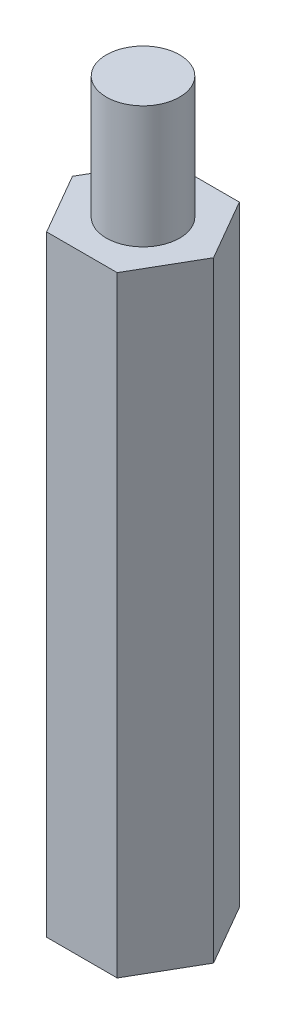
ISO-10303-21;
HEADER;
FILE_DESCRIPTION(('STEP AP214'),'2;1');
FILE_NAME('part.step','',(''),(''),'','','');
FILE_SCHEMA(('AUTOMOTIVE_DESIGN { 1 0 10303 214 1 1 1 1 }'));
ENDSEC;
DATA;
#1=APPLICATION_CONTEXT('core data for automotive mechanical design processes');
#2=APPLICATION_PROTOCOL_DEFINITION('international standard','automotive_design',2000,#1);
#3=PRODUCT_CONTEXT('',#1,'mechanical');
#4=PRODUCT('Part','Part','',(#3));
#5=PRODUCT_RELATED_PRODUCT_CATEGORY('part','',(#4));
#6=PRODUCT_DEFINITION_FORMATION('','',#4);
#7=PRODUCT_DEFINITION_CONTEXT('part definition',#1,'design');
#8=PRODUCT_DEFINITION('design','',#6,#7);
#9=PRODUCT_DEFINITION_SHAPE('','',#8);
#10=(LENGTH_UNIT() NAMED_UNIT(*) SI_UNIT(.MILLI.,.METRE.));
#11=(NAMED_UNIT(*) PLANE_ANGLE_UNIT() SI_UNIT($,.RADIAN.));
#12=(NAMED_UNIT(*) SI_UNIT($,.STERADIAN.) SOLID_ANGLE_UNIT());
#13=UNCERTAINTY_MEASURE_WITH_UNIT(LENGTH_MEASURE(1.E-05),#10,'distance_accuracy_value','');
#14=(GEOMETRIC_REPRESENTATION_CONTEXT(3) GLOBAL_UNCERTAINTY_ASSIGNED_CONTEXT((#13)) GLOBAL_UNIT_ASSIGNED_CONTEXT((#10,
#11,#12)) REPRESENTATION_CONTEXT('',''));
#15=CARTESIAN_POINT('',(0.,0.,0.));
#16=DIRECTION('',(0.,0.,1.));
#17=DIRECTION('',(1.,0.,0.));
#18=AXIS2_PLACEMENT_3D('',#15,#16,#17);
#19=CARTESIAN_POINT('',(1.44337567297409,25.,2.49999999999997));
#20=DIRECTION('',(-0.866025403784442,0.,-0.499999999999995));
#21=DIRECTION('',(-0.499999999999995,0.,0.866025403784442));
#22=AXIS2_PLACEMENT_3D('',#19,#20,#21);
#23=PLANE('',#22);
#24=DIRECTION('',(0.499999999999995,0.,-0.866025403784442));
#25=VECTOR('',#24,1.);
#26=CARTESIAN_POINT('',(1.44337567297409,0.,2.49999999999997));
#27=LINE('',#26,#25);
#28=CARTESIAN_POINT('',(1.44337567297409,0.,2.49999999999997));
#29=VERTEX_POINT('',#28);
#30=CARTESIAN_POINT('',(2.88675134594812,0.,0.));
#31=VERTEX_POINT('',#30);
#32=EDGE_CURVE('E119',#29,#31,#27,.T.);
#33=ORIENTED_EDGE('',*,*,#32,.T.);
#34=DIRECTION('',(0.,-1.,0.));
#35=VECTOR('',#34,1.);
#36=CARTESIAN_POINT('',(2.88675134594812,25.,0.));
#37=LINE('',#36,#35);
#38=CARTESIAN_POINT('',(2.88675134594812,25.,0.));
#39=VERTEX_POINT('',#38);
#40=EDGE_CURVE('E36',#39,#31,#37,.T.);
#41=ORIENTED_EDGE('',*,*,#40,.F.);
#42=DIRECTION('',(0.499999999999995,0.,-0.866025403784442));
#43=VECTOR('',#42,1.);
#44=CARTESIAN_POINT('',(1.44337567297409,25.,2.49999999999997));
#45=LINE('',#44,#43);
#46=CARTESIAN_POINT('',(1.44337567297409,25.,2.49999999999997));
#47=VERTEX_POINT('',#46);
#48=EDGE_CURVE('E130',#47,#39,#45,.T.);
#49=ORIENTED_EDGE('',*,*,#48,.F.);
#50=DIRECTION('',(0.,-1.,0.));
#51=VECTOR('',#50,1.);
#52=CARTESIAN_POINT('',(1.44337567297409,25.,2.49999999999997));
#53=LINE('',#52,#51);
#54=EDGE_CURVE('E115',#47,#29,#53,.T.);
#55=ORIENTED_EDGE('',*,*,#54,.T.);
#56=EDGE_LOOP('',(#33,#41,#49,#55));
#57=FACE_BOUND('',#56,.T.);
#58=ADVANCED_FACE('F33',(#57),#23,.F.);
#59=CARTESIAN_POINT('',(2.88675134594812,25.,0.));
#60=DIRECTION('',(-0.866025403784438,0.,0.500000000000001));
#61=DIRECTION('',(0.500000000000001,0.,0.866025403784438));
#62=AXIS2_PLACEMENT_3D('',#59,#60,#61);
#63=PLANE('',#62);
#64=DIRECTION('',(-0.500000000000001,0.,-0.866025403784438));
#65=VECTOR('',#64,1.);
#66=CARTESIAN_POINT('',(2.88675134594812,0.,0.));
#67=LINE('',#66,#65);
#68=CARTESIAN_POINT('',(1.44337567297405,0.,-2.49999999999999));
#69=VERTEX_POINT('',#68);
#70=EDGE_CURVE('E122',#31,#69,#67,.T.);
#71=ORIENTED_EDGE('',*,*,#70,.T.);
#72=DIRECTION('',(0.,-1.,0.));
#73=VECTOR('',#72,1.);
#74=CARTESIAN_POINT('',(1.44337567297405,25.,-2.49999999999999));
#75=LINE('',#74,#73);
#76=CARTESIAN_POINT('',(1.44337567297405,25.,-2.49999999999999));
#77=VERTEX_POINT('',#76);
#78=EDGE_CURVE('E133',#77,#69,#75,.T.);
#79=ORIENTED_EDGE('',*,*,#78,.F.);
#80=DIRECTION('',(-0.500000000000001,0.,-0.866025403784438));
#81=VECTOR('',#80,1.);
#82=CARTESIAN_POINT('',(2.88675134594812,25.,0.));
#83=LINE('',#82,#81);
#84=EDGE_CURVE('E88',#39,#77,#83,.T.);
#85=ORIENTED_EDGE('',*,*,#84,.F.);
#86=ORIENTED_EDGE('',*,*,#40,.T.);
#87=EDGE_LOOP('',(#71,#79,#85,#86));
#88=FACE_BOUND('',#87,.T.);
#89=ADVANCED_FACE('F138',(#88),#63,.F.);
#90=CARTESIAN_POINT('',(1.44337567297405,25.,-2.49999999999999));
#91=DIRECTION('',(0.,0.,1.));
#92=DIRECTION('',(1.,0.,0.));
#93=AXIS2_PLACEMENT_3D('',#90,#91,#92);
#94=PLANE('',#93);
#95=DIRECTION('',(-1.,0.,0.));
#96=VECTOR('',#95,1.);
#97=CARTESIAN_POINT('',(1.44337567297405,0.,-2.49999999999999));
#98=LINE('',#97,#96);
#99=CARTESIAN_POINT('',(-1.44337567297407,0.,-2.49999999999998));
#100=VERTEX_POINT('',#99);
#101=EDGE_CURVE('E125',#69,#100,#98,.T.);
#102=ORIENTED_EDGE('',*,*,#101,.T.);
#103=DIRECTION('',(0.,-1.,0.));
#104=VECTOR('',#103,1.);
#105=CARTESIAN_POINT('',(-1.44337567297407,25.,-2.49999999999998));
#106=LINE('',#105,#104);
#107=CARTESIAN_POINT('',(-1.44337567297407,25.,-2.49999999999998));
#108=VERTEX_POINT('',#107);
#109=EDGE_CURVE('E110',#108,#100,#106,.T.);
#110=ORIENTED_EDGE('',*,*,#109,.F.);
#111=DIRECTION('',(-1.,0.,0.));
#112=VECTOR('',#111,1.);
#113=CARTESIAN_POINT('',(1.44337567297405,25.,-2.49999999999999));
#114=LINE('',#113,#112);
#115=EDGE_CURVE('E101',#77,#108,#114,.T.);
#116=ORIENTED_EDGE('',*,*,#115,.F.);
#117=ORIENTED_EDGE('',*,*,#78,.T.);
#118=EDGE_LOOP('',(#102,#110,#116,#117));
#119=FACE_BOUND('',#118,.T.);
#120=ADVANCED_FACE('F144',(#119),#94,.F.);
#121=CARTESIAN_POINT('',(-1.44337567297407,25.,-2.49999999999998));
#122=DIRECTION('',(0.866025403784442,0.,0.499999999999995));
#123=DIRECTION('',(0.499999999999995,0.,-0.866025403784442));
#124=AXIS2_PLACEMENT_3D('',#121,#122,#123);
#125=PLANE('',#124);
#126=DIRECTION('',(-0.499999999999995,0.,0.866025403784442));
#127=VECTOR('',#126,1.);
#128=CARTESIAN_POINT('',(-1.44337567297407,0.,-2.49999999999998));
#129=LINE('',#128,#127);
#130=CARTESIAN_POINT('',(-2.88675134594812,0.,0.));
#131=VERTEX_POINT('',#130);
#132=EDGE_CURVE('E109',#100,#131,#129,.T.);
#133=ORIENTED_EDGE('',*,*,#132,.T.);
#134=DIRECTION('',(0.,-1.,0.));
#135=VECTOR('',#134,1.);
#136=CARTESIAN_POINT('',(-2.88675134594812,25.,0.));
#137=LINE('',#136,#135);
#138=CARTESIAN_POINT('',(-2.88675134594812,25.,0.));
#139=VERTEX_POINT('',#138);
#140=EDGE_CURVE('E106',#139,#131,#137,.T.);
#141=ORIENTED_EDGE('',*,*,#140,.F.);
#142=DIRECTION('',(-0.499999999999995,0.,0.866025403784442));
#143=VECTOR('',#142,1.);
#144=CARTESIAN_POINT('',(-1.44337567297407,25.,-2.49999999999998));
#145=LINE('',#144,#143);
#146=EDGE_CURVE('E95',#108,#139,#145,.T.);
#147=ORIENTED_EDGE('',*,*,#146,.F.);
#148=ORIENTED_EDGE('',*,*,#109,.T.);
#149=EDGE_LOOP('',(#133,#141,#147,#148));
#150=FACE_BOUND('',#149,.T.);
#151=ADVANCED_FACE('F107',(#150),#125,.F.);
#152=CARTESIAN_POINT('',(-2.88675134594812,25.,0.));
#153=DIRECTION('',(0.866025403784435,0.,-0.500000000000007));
#154=DIRECTION('',(-0.500000000000007,0.,-0.866025403784435));
#155=AXIS2_PLACEMENT_3D('',#152,#153,#154);
#156=PLANE('',#155);
#157=DIRECTION('',(0.500000000000007,0.,0.866025403784435));
#158=VECTOR('',#157,1.);
#159=CARTESIAN_POINT('',(-2.88675134594812,0.,0.));
#160=LINE('',#159,#158);
#161=CARTESIAN_POINT('',(-1.44337567297404,0.,2.5));
#162=VERTEX_POINT('',#161);
#163=EDGE_CURVE('E73',#131,#162,#160,.T.);
#164=ORIENTED_EDGE('',*,*,#163,.T.);
#165=DIRECTION('',(0.,-1.,0.));
#166=VECTOR('',#165,1.);
#167=CARTESIAN_POINT('',(-1.44337567297404,25.,2.5));
#168=LINE('',#167,#166);
#169=CARTESIAN_POINT('',(-1.44337567297404,25.,2.5));
#170=VERTEX_POINT('',#169);
#171=EDGE_CURVE('E111',#170,#162,#168,.T.);
#172=ORIENTED_EDGE('',*,*,#171,.F.);
#173=DIRECTION('',(0.500000000000007,0.,0.866025403784435));
#174=VECTOR('',#173,1.);
#175=CARTESIAN_POINT('',(-2.88675134594812,25.,0.));
#176=LINE('',#175,#174);
#177=EDGE_CURVE('E99',#139,#170,#176,.T.);
#178=ORIENTED_EDGE('',*,*,#177,.F.);
#179=ORIENTED_EDGE('',*,*,#140,.T.);
#180=EDGE_LOOP('',(#164,#172,#178,#179));
#181=FACE_BOUND('',#180,.T.);
#182=ADVANCED_FACE('F113',(#181),#156,.F.);
#183=CARTESIAN_POINT('',(-1.44337567297404,25.,2.5));
#184=DIRECTION('',(0.,0.,-1.));
#185=DIRECTION('',(-1.,0.,0.));
#186=AXIS2_PLACEMENT_3D('',#183,#184,#185);
#187=PLANE('',#186);
#188=DIRECTION('',(1.,0.,0.));
#189=VECTOR('',#188,1.);
#190=CARTESIAN_POINT('',(-1.44337567297404,0.,2.5));
#191=LINE('',#190,#189);
#192=EDGE_CURVE('E79',#162,#29,#191,.T.);
#193=ORIENTED_EDGE('',*,*,#192,.T.);
#194=ORIENTED_EDGE('',*,*,#54,.F.);
#195=DIRECTION('',(1.,0.,0.));
#196=VECTOR('',#195,1.);
#197=CARTESIAN_POINT('',(-1.44337567297404,25.,2.5));
#198=LINE('',#197,#196);
#199=EDGE_CURVE('E50',#170,#47,#198,.T.);
#200=ORIENTED_EDGE('',*,*,#199,.F.);
#201=ORIENTED_EDGE('',*,*,#171,.T.);
#202=EDGE_LOOP('',(#193,#194,#200,#201));
#203=FACE_BOUND('',#202,.T.);
#204=ADVANCED_FACE('F175',(#203),#187,.F.);
#205=CARTESIAN_POINT('',(0.,25.,0.));
#206=DIRECTION('',(0.,1.,0.));
#207=DIRECTION('',(0.,0.,1.));
#208=AXIS2_PLACEMENT_3D('',#205,#206,#207);
#209=PLANE('',#208);
#210=CARTESIAN_POINT('',(0.,25.,0.));
#211=DIRECTION('',(0.,1.,0.));
#212=DIRECTION('',(0.,0.,1.));
#213=AXIS2_PLACEMENT_3D('',#210,#211,#212);
#214=CIRCLE('',#213,1.5);
#215=CARTESIAN_POINT('',(0.,25.,1.5));
#216=VERTEX_POINT('',#215);
#217=EDGE_CURVE('E11',#216,#216,#214,.T.);
#218=ORIENTED_EDGE('',*,*,#217,.F.);
#219=EDGE_LOOP('',(#218));
#220=FACE_BOUND('',#219,.T.);
#221=ORIENTED_EDGE('',*,*,#48,.T.);
#222=ORIENTED_EDGE('',*,*,#84,.T.);
#223=ORIENTED_EDGE('',*,*,#115,.T.);
#224=ORIENTED_EDGE('',*,*,#146,.T.);
#225=ORIENTED_EDGE('',*,*,#177,.T.);
#226=ORIENTED_EDGE('',*,*,#199,.T.);
#227=EDGE_LOOP('',(#221,#222,#223,#224,#225,#226));
#228=FACE_BOUND('',#227,.T.);
#229=ADVANCED_FACE('F97',(#220,#228),#209,.T.);
#230=CARTESIAN_POINT('',(0.,0.,0.));
#231=DIRECTION('',(0.,1.,0.));
#232=DIRECTION('',(0.,0.,1.));
#233=AXIS2_PLACEMENT_3D('',#230,#231,#232);
#234=PLANE('',#233);
#235=CARTESIAN_POINT('',(0.,0.,0.));
#236=DIRECTION('',(0.,-1.,0.));
#237=DIRECTION('',(0.,0.,-1.));
#238=AXIS2_PLACEMENT_3D('',#235,#236,#237);
#239=CIRCLE('',#238,1.5);
#240=CARTESIAN_POINT('',(0.,0.,-1.5));
#241=VERTEX_POINT('',#240);
#242=EDGE_CURVE('E151',#241,#241,#239,.T.);
#243=ORIENTED_EDGE('',*,*,#242,.F.);
#244=EDGE_LOOP('',(#243));
#245=FACE_BOUND('',#244,.T.);
#246=ORIENTED_EDGE('',*,*,#32,.F.);
#247=ORIENTED_EDGE('',*,*,#192,.F.);
#248=ORIENTED_EDGE('',*,*,#163,.F.);
#249=ORIENTED_EDGE('',*,*,#132,.F.);
#250=ORIENTED_EDGE('',*,*,#101,.F.);
#251=ORIENTED_EDGE('',*,*,#70,.F.);
#252=EDGE_LOOP('',(#246,#247,#248,#249,#250,#251));
#253=FACE_BOUND('',#252,.T.);
#254=ADVANCED_FACE('F143',(#245,#253),#234,.F.);
#255=CARTESIAN_POINT('',(0.,30.,0.));
#256=DIRECTION('',(0.,-1.,0.));
#257=DIRECTION('',(0.,0.,-1.));
#258=AXIS2_PLACEMENT_3D('',#255,#256,#257);
#259=CYLINDRICAL_SURFACE('',#258,1.5);
#260=CARTESIAN_POINT('',(0.,30.,0.));
#261=DIRECTION('',(0.,1.,0.));
#262=DIRECTION('',(0.,0.,1.));
#263=AXIS2_PLACEMENT_3D('',#260,#261,#262);
#264=CIRCLE('',#263,1.5);
#265=CARTESIAN_POINT('',(0.,30.,1.5));
#266=VERTEX_POINT('',#265);
#267=EDGE_CURVE('E123',#266,#266,#264,.T.);
#268=ORIENTED_EDGE('',*,*,#267,.F.);
#269=EDGE_LOOP('',(#268));
#270=FACE_BOUND('',#269,.T.);
#271=ORIENTED_EDGE('',*,*,#217,.T.);
#272=EDGE_LOOP('',(#271));
#273=FACE_BOUND('',#272,.T.);
#274=ADVANCED_FACE('F167',(#270,#273),#259,.T.);
#275=CARTESIAN_POINT('',(0.,30.,0.));
#276=DIRECTION('',(0.,1.,0.));
#277=DIRECTION('',(0.,0.,1.));
#278=AXIS2_PLACEMENT_3D('',#275,#276,#277);
#279=PLANE('',#278);
#280=ORIENTED_EDGE('',*,*,#267,.T.);
#281=EDGE_LOOP('',(#280));
#282=FACE_BOUND('',#281,.T.);
#283=ADVANCED_FACE('F162',(#282),#279,.T.);
#284=CARTESIAN_POINT('',(0.,5.,0.));
#285=DIRECTION('',(0.,-1.,0.));
#286=DIRECTION('',(0.,0.,-1.));
#287=AXIS2_PLACEMENT_3D('',#284,#285,#286);
#288=CYLINDRICAL_SURFACE('',#287,1.5);
#289=CARTESIAN_POINT('',(0.,5.,0.));
#290=DIRECTION('',(0.,-1.,0.));
#291=DIRECTION('',(0.,0.,-1.));
#292=AXIS2_PLACEMENT_3D('',#289,#290,#291);
#293=CIRCLE('',#292,1.5);
#294=CARTESIAN_POINT('',(0.,5.,-1.5));
#295=VERTEX_POINT('',#294);
#296=EDGE_CURVE('E150',#295,#295,#293,.T.);
#297=ORIENTED_EDGE('',*,*,#296,.F.);
#298=EDGE_LOOP('',(#297));
#299=FACE_BOUND('',#298,.T.);
#300=ORIENTED_EDGE('',*,*,#242,.T.);
#301=EDGE_LOOP('',(#300));
#302=FACE_BOUND('',#301,.T.);
#303=ADVANCED_FACE('F159',(#299,#302),#288,.F.);
#304=CARTESIAN_POINT('',(0.,5.,0.));
#305=DIRECTION('',(0.,-1.,0.));
#306=DIRECTION('',(0.,0.,-1.));
#307=AXIS2_PLACEMENT_3D('',#304,#305,#306);
#308=PLANE('',#307);
#309=ORIENTED_EDGE('',*,*,#296,.T.);
#310=EDGE_LOOP('',(#309));
#311=FACE_BOUND('',#310,.T.);
#312=ADVANCED_FACE('F157',(#311),#308,.T.);
#313=CLOSED_SHELL('',(#58,#89,#120,#151,#182,#204,#229,#254,#274,#283,#303,#312));
#314=MANIFOLD_SOLID_BREP('B2',#313);
#315=ADVANCED_BREP_SHAPE_REPRESENTATION('',(#18,#314),#14);
#316=SHAPE_DEFINITION_REPRESENTATION(#9,#315);
ENDSEC;
END-ISO-10303-21;
